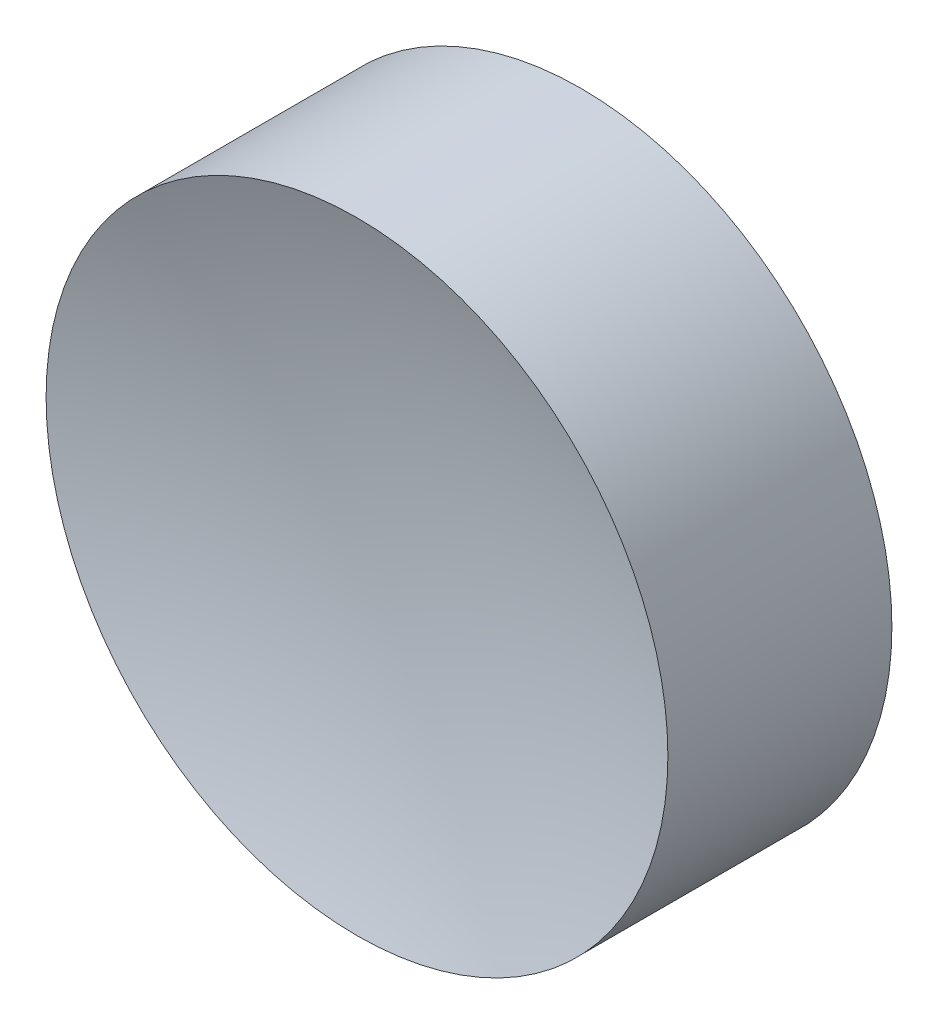
ISO-10303-21;
HEADER;
FILE_DESCRIPTION(('STEP AP214'),'2;1');
FILE_NAME('part.step','',(''),(''),'','','');
FILE_SCHEMA(('AUTOMOTIVE_DESIGN { 1 0 10303 214 1 1 1 1 }'));
ENDSEC;
DATA;
#1=APPLICATION_CONTEXT('core data for automotive mechanical design processes');
#2=APPLICATION_PROTOCOL_DEFINITION('international standard','automotive_design',2000,#1);
#3=PRODUCT_CONTEXT('',#1,'mechanical');
#4=PRODUCT('Part','Part','',(#3));
#5=PRODUCT_RELATED_PRODUCT_CATEGORY('part','',(#4));
#6=PRODUCT_DEFINITION_FORMATION('','',#4);
#7=PRODUCT_DEFINITION_CONTEXT('part definition',#1,'design');
#8=PRODUCT_DEFINITION('design','',#6,#7);
#9=PRODUCT_DEFINITION_SHAPE('','',#8);
#10=(LENGTH_UNIT() NAMED_UNIT(*) SI_UNIT(.MILLI.,.METRE.));
#11=(NAMED_UNIT(*) PLANE_ANGLE_UNIT() SI_UNIT($,.RADIAN.));
#12=(NAMED_UNIT(*) SI_UNIT($,.STERADIAN.) SOLID_ANGLE_UNIT());
#13=UNCERTAINTY_MEASURE_WITH_UNIT(LENGTH_MEASURE(1.E-05),#10,'distance_accuracy_value','');
#14=(GEOMETRIC_REPRESENTATION_CONTEXT(3) GLOBAL_UNCERTAINTY_ASSIGNED_CONTEXT((#13)) GLOBAL_UNIT_ASSIGNED_CONTEXT((#10,
#11,#12)) REPRESENTATION_CONTEXT('',''));
#15=CARTESIAN_POINT('',(0.,0.,0.));
#16=DIRECTION('',(0.,0.,1.));
#17=DIRECTION('',(1.,0.,0.));
#18=AXIS2_PLACEMENT_3D('',#15,#16,#17);
#19=CARTESIAN_POINT('',(0.,0.,15.26));
#20=DIRECTION('',(0.,0.,1.));
#21=DIRECTION('',(0.,1.,0.));
#22=AXIS2_PLACEMENT_3D('',#19,#20,#21);
#23=SPHERICAL_SURFACE('',#22,14.01);
#24=CARTESIAN_POINT('',(0.,0.,1.99236645064388));
#25=DIRECTION('',(0.,0.,1.));
#26=DIRECTION('',(1.,0.,0.));
#27=AXIS2_PLACEMENT_3D('',#24,#25,#26);
#28=CIRCLE('',#27,4.5);
#29=CARTESIAN_POINT('',(4.5,0.,1.99236645064388));
#30=VERTEX_POINT('',#29);
#31=EDGE_CURVE('E19',#30,#30,#28,.T.);
#32=ORIENTED_EDGE('',*,*,#31,.T.);
#33=EDGE_LOOP('',(#32));
#34=FACE_BOUND('',#33,.T.);
#35=ADVANCED_FACE('F13',(#34),#23,.F.);
#36=CARTESIAN_POINT('',(0.,0.,-1.25));
#37=DIRECTION('',(0.,0.,1.));
#38=DIRECTION('',(1.,0.,0.));
#39=AXIS2_PLACEMENT_3D('',#36,#37,#38);
#40=PLANE('',#39);
#41=CARTESIAN_POINT('',(0.,0.,-1.25));
#42=DIRECTION('',(0.,0.,1.));
#43=DIRECTION('',(1.,0.,0.));
#44=AXIS2_PLACEMENT_3D('',#41,#42,#43);
#45=CIRCLE('',#44,4.5);
#46=CARTESIAN_POINT('',(4.5,0.,-1.25));
#47=VERTEX_POINT('',#46);
#48=EDGE_CURVE('E9',#47,#47,#45,.T.);
#49=ORIENTED_EDGE('',*,*,#48,.F.);
#50=EDGE_LOOP('',(#49));
#51=FACE_BOUND('',#50,.T.);
#52=ADVANCED_FACE('F28',(#51),#40,.F.);
#53=CARTESIAN_POINT('',(0.,0.,9.01715327042933));
#54=DIRECTION('',(0.,0.,1.));
#55=DIRECTION('',(1.,0.,0.));
#56=AXIS2_PLACEMENT_3D('',#53,#54,#55);
#57=CYLINDRICAL_SURFACE('',#56,4.5);
#58=ORIENTED_EDGE('',*,*,#31,.F.);
#59=EDGE_LOOP('',(#58));
#60=FACE_BOUND('',#59,.T.);
#61=ORIENTED_EDGE('',*,*,#48,.T.);
#62=EDGE_LOOP('',(#61));
#63=FACE_BOUND('',#62,.T.);
#64=ADVANCED_FACE('F26',(#60,#63),#57,.T.);
#65=CLOSED_SHELL('',(#35,#52,#64));
#66=MANIFOLD_SOLID_BREP('B1',#65);
#67=ADVANCED_BREP_SHAPE_REPRESENTATION('',(#18,#66),#14);
#68=SHAPE_DEFINITION_REPRESENTATION(#9,#67);
ENDSEC;
END-ISO-10303-21;
